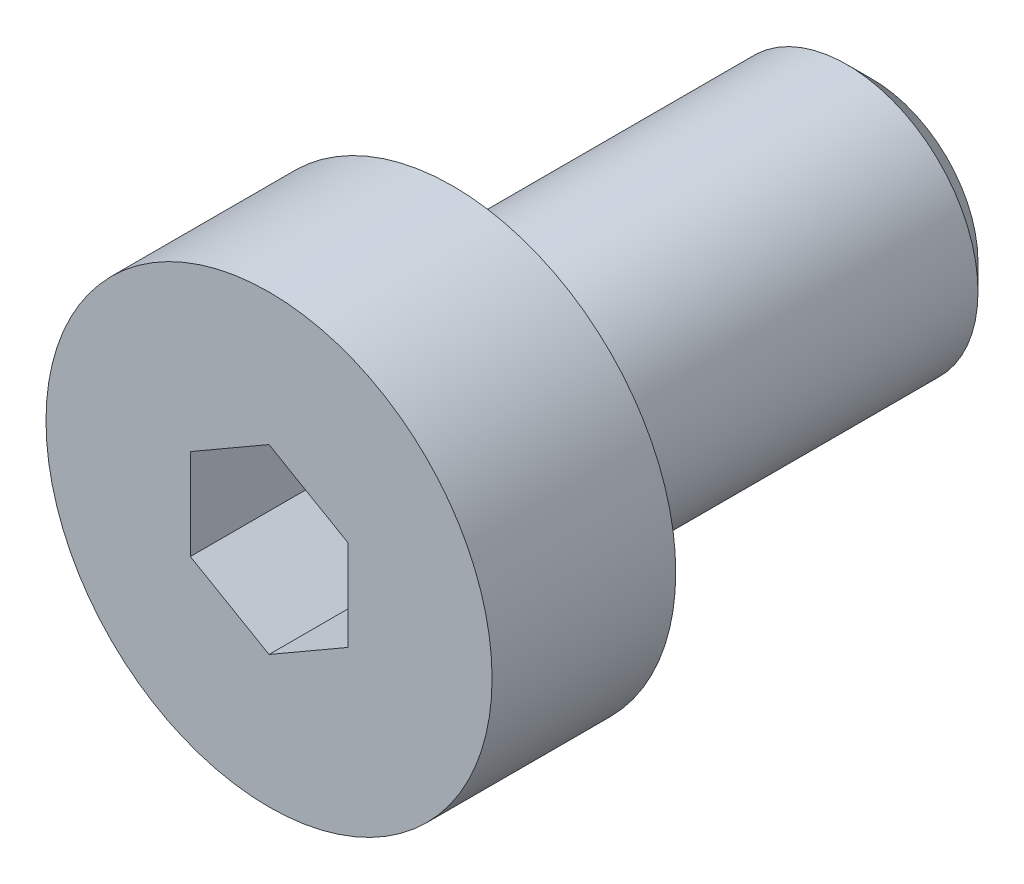
ISO-10303-21;
HEADER;
FILE_DESCRIPTION(('STEP AP214'),'2;1');
FILE_NAME('part.step','',(''),(''),'','','');
FILE_SCHEMA(('AUTOMOTIVE_DESIGN { 1 0 10303 214 1 1 1 1 }'));
ENDSEC;
DATA;
#1=APPLICATION_CONTEXT('core data for automotive mechanical design processes');
#2=APPLICATION_PROTOCOL_DEFINITION('international standard','automotive_design',2000,#1);
#3=PRODUCT_CONTEXT('',#1,'mechanical');
#4=PRODUCT('Part','Part','',(#3));
#5=PRODUCT_RELATED_PRODUCT_CATEGORY('part','',(#4));
#6=PRODUCT_DEFINITION_FORMATION('','',#4);
#7=PRODUCT_DEFINITION_CONTEXT('part definition',#1,'design');
#8=PRODUCT_DEFINITION('design','',#6,#7);
#9=PRODUCT_DEFINITION_SHAPE('','',#8);
#10=(LENGTH_UNIT() NAMED_UNIT(*) SI_UNIT(.MILLI.,.METRE.));
#11=(NAMED_UNIT(*) PLANE_ANGLE_UNIT() SI_UNIT($,.RADIAN.));
#12=(NAMED_UNIT(*) SI_UNIT($,.STERADIAN.) SOLID_ANGLE_UNIT());
#13=UNCERTAINTY_MEASURE_WITH_UNIT(LENGTH_MEASURE(1.E-05),#10,'distance_accuracy_value','');
#14=(GEOMETRIC_REPRESENTATION_CONTEXT(3) GLOBAL_UNCERTAINTY_ASSIGNED_CONTEXT((#13)) GLOBAL_UNIT_ASSIGNED_CONTEXT((#10,
#11,#12)) REPRESENTATION_CONTEXT('',''));
#15=CARTESIAN_POINT('',(0.,0.,0.));
#16=DIRECTION('',(0.,0.,1.));
#17=DIRECTION('',(1.,0.,0.));
#18=AXIS2_PLACEMENT_3D('',#15,#16,#17);
#19=CARTESIAN_POINT('',(13.,-21.5,-3.3));
#20=DIRECTION('',(0.,0.,-1.));
#21=DIRECTION('',(-1.,0.,0.));
#22=AXIS2_PLACEMENT_3D('',#19,#20,#21);
#23=PLANE('',#22);
#24=DIRECTION('',(-0.866025403784439,0.5,0.));
#25=VECTOR('',#24,1.);
#26=CARTESIAN_POINT('',(14.5,-20.6339745962156,-3.3));
#27=LINE('',#26,#25);
#28=CARTESIAN_POINT('',(13.7500000000061,-20.2009618943127,-3.29999999999145));
#29=VERTEX_POINT('',#28);
#30=CARTESIAN_POINT('',(13.,-19.7679491924311,-3.3));
#31=VERTEX_POINT('',#30);
#32=EDGE_CURVE('E179',#29,#31,#27,.T.);
#33=ORIENTED_EDGE('',*,*,#32,.T.);
#34=DIRECTION('',(-0.866025403784439,-0.5,0.));
#35=VECTOR('',#34,1.);
#36=CARTESIAN_POINT('',(13.,-19.7679491924311,-3.3));
#37=LINE('',#36,#35);
#38=CARTESIAN_POINT('',(12.2499999999939,-20.2009618943127,-3.29999999999145));
#39=VERTEX_POINT('',#38);
#40=EDGE_CURVE('E169',#31,#39,#37,.T.);
#41=ORIENTED_EDGE('',*,*,#40,.T.);
#42=CARTESIAN_POINT('',(13.,-21.5,-3.2999999999829));
#43=DIRECTION('',(0.,0.,1.));
#44=DIRECTION('',(1.,0.,0.));
#45=AXIS2_PLACEMENT_3D('',#42,#43,#44);
#46=CIRCLE('',#45,1.50000000002456);
#47=EDGE_CURVE('E130',#39,#29,#46,.F.);
#48=ORIENTED_EDGE('',*,*,#47,.T.);
#49=EDGE_LOOP('',(#33,#41,#48));
#50=FACE_BOUND('',#49,.T.);
#51=ADVANCED_FACE('F17',(#50),#23,.F.);
#52=CARTESIAN_POINT('',(13.,-21.5,-3.3));
#53=DIRECTION('',(0.,0.,-1.));
#54=DIRECTION('',(-1.,0.,0.));
#55=AXIS2_PLACEMENT_3D('',#52,#53,#54);
#56=PLANE('',#55);
#57=DIRECTION('',(0.,1.,0.));
#58=VECTOR('',#57,1.);
#59=CARTESIAN_POINT('',(14.5,-22.3660254037844,-3.3));
#60=LINE('',#59,#58);
#61=CARTESIAN_POINT('',(14.5000000000123,-21.5,-3.29999999999145));
#62=VERTEX_POINT('',#61);
#63=CARTESIAN_POINT('',(14.5,-20.6339745962156,-3.3));
#64=VERTEX_POINT('',#63);
#65=EDGE_CURVE('E147',#62,#64,#60,.T.);
#66=ORIENTED_EDGE('',*,*,#65,.T.);
#67=DIRECTION('',(-0.866025403784439,0.5,0.));
#68=VECTOR('',#67,1.);
#69=CARTESIAN_POINT('',(14.5,-20.6339745962156,-3.3));
#70=LINE('',#69,#68);
#71=EDGE_CURVE('E176',#64,#29,#70,.T.);
#72=ORIENTED_EDGE('',*,*,#71,.T.);
#73=CARTESIAN_POINT('',(13.,-21.5,-3.2999999999829));
#74=DIRECTION('',(0.,0.,1.));
#75=DIRECTION('',(1.,0.,0.));
#76=AXIS2_PLACEMENT_3D('',#73,#74,#75);
#77=CIRCLE('',#76,1.50000000002456);
#78=EDGE_CURVE('E180',#62,#29,#77,.T.);
#79=ORIENTED_EDGE('',*,*,#78,.F.);
#80=EDGE_LOOP('',(#66,#72,#79));
#81=FACE_BOUND('',#80,.T.);
#82=ADVANCED_FACE('F512',(#81),#56,.F.);
#83=CARTESIAN_POINT('',(14.5,-20.6339745962156,-0.6));
#84=DIRECTION('',(0.5,0.866025403784439,0.));
#85=DIRECTION('',(-0.866025403784439,0.5,0.));
#86=AXIS2_PLACEMENT_3D('',#83,#84,#85);
#87=PLANE('',#86);
#88=DIRECTION('',(0.,0.,1.));
#89=VECTOR('',#88,1.);
#90=CARTESIAN_POINT('',(13.,-19.7679491924311,-0.6));
#91=LINE('',#90,#89);
#92=CARTESIAN_POINT('',(13.,-19.7679491924311,-0.6));
#93=VERTEX_POINT('',#92);
#94=EDGE_CURVE('E188',#93,#31,#91,.F.);
#95=ORIENTED_EDGE('',*,*,#94,.T.);
#96=ORIENTED_EDGE('',*,*,#32,.F.);
#97=ORIENTED_EDGE('',*,*,#71,.F.);
#98=DIRECTION('',(0.,0.,-1.));
#99=VECTOR('',#98,1.);
#100=CARTESIAN_POINT('',(14.5,-20.6339745962156,-0.6));
#101=LINE('',#100,#99);
#102=CARTESIAN_POINT('',(14.5,-20.6339745962156,-0.6));
#103=VERTEX_POINT('',#102);
#104=EDGE_CURVE('E173',#64,#103,#101,.F.);
#105=ORIENTED_EDGE('',*,*,#104,.T.);
#106=DIRECTION('',(-0.866025403784439,0.5,0.));
#107=VECTOR('',#106,1.);
#108=CARTESIAN_POINT('',(14.5,-20.6339745962156,-0.6));
#109=LINE('',#108,#107);
#110=EDGE_CURVE('E193',#93,#103,#109,.F.);
#111=ORIENTED_EDGE('',*,*,#110,.F.);
#112=EDGE_LOOP('',(#95,#96,#97,#105,#111));
#113=FACE_BOUND('',#112,.T.);
#114=ADVANCED_FACE('F502',(#113),#87,.F.);
#115=CARTESIAN_POINT('',(13.,-19.7679491924311,-0.6));
#116=DIRECTION('',(-0.5,0.866025403784439,0.));
#117=DIRECTION('',(-0.866025403784439,-0.5,0.));
#118=AXIS2_PLACEMENT_3D('',#115,#116,#117);
#119=PLANE('',#118);
#120=DIRECTION('',(0.,0.,1.));
#121=VECTOR('',#120,1.);
#122=CARTESIAN_POINT('',(11.5,-20.6339745962156,-0.6));
#123=LINE('',#122,#121);
#124=CARTESIAN_POINT('',(11.5,-20.6339745962156,-0.6));
#125=VERTEX_POINT('',#124);
#126=CARTESIAN_POINT('',(11.5,-20.6339745962156,-3.3));
#127=VERTEX_POINT('',#126);
#128=EDGE_CURVE('E155',#125,#127,#123,.F.);
#129=ORIENTED_EDGE('',*,*,#128,.T.);
#130=DIRECTION('',(0.866025403784398,0.500000000000071,0.));
#131=VECTOR('',#130,1.);
#132=CARTESIAN_POINT('',(11.5,-20.6339745962156,-3.3));
#133=LINE('',#132,#131);
#134=EDGE_CURVE('E112',#127,#39,#133,.T.);
#135=ORIENTED_EDGE('',*,*,#134,.T.);
#136=ORIENTED_EDGE('',*,*,#40,.F.);
#137=ORIENTED_EDGE('',*,*,#94,.F.);
#138=DIRECTION('',(-0.866025403784439,-0.5,0.));
#139=VECTOR('',#138,1.);
#140=CARTESIAN_POINT('',(13.,-19.7679491924311,-0.6));
#141=LINE('',#140,#139);
#142=EDGE_CURVE('E164',#125,#93,#141,.F.);
#143=ORIENTED_EDGE('',*,*,#142,.F.);
#144=EDGE_LOOP('',(#129,#135,#136,#137,#143));
#145=FACE_BOUND('',#144,.T.);
#146=ADVANCED_FACE('F492',(#145),#119,.F.);
#147=CARTESIAN_POINT('',(13.,-21.5,-3.3));
#148=DIRECTION('',(0.,0.,-1.));
#149=DIRECTION('',(-1.,0.,0.));
#150=AXIS2_PLACEMENT_3D('',#147,#148,#149);
#151=PLANE('',#150);
#152=ORIENTED_EDGE('',*,*,#134,.F.);
#153=DIRECTION('',(0.,1.,0.));
#154=VECTOR('',#153,1.);
#155=CARTESIAN_POINT('',(11.5,-20.6339745962156,-3.3));
#156=LINE('',#155,#154);
#157=CARTESIAN_POINT('',(11.4999999999877,-21.5,-3.29999999999145));
#158=VERTEX_POINT('',#157);
#159=EDGE_CURVE('E152',#127,#158,#156,.F.);
#160=ORIENTED_EDGE('',*,*,#159,.T.);
#161=CARTESIAN_POINT('',(13.,-21.5,-3.2999999999829));
#162=DIRECTION('',(0.,0.,1.));
#163=DIRECTION('',(1.,0.,0.));
#164=AXIS2_PLACEMENT_3D('',#161,#162,#163);
#165=CIRCLE('',#164,1.50000000002455);
#166=EDGE_CURVE('E111',#158,#39,#165,.F.);
#167=ORIENTED_EDGE('',*,*,#166,.T.);
#168=EDGE_LOOP('',(#152,#160,#167));
#169=FACE_BOUND('',#168,.T.);
#170=ADVANCED_FACE('F483',(#169),#151,.F.);
#171=CARTESIAN_POINT('',(13.,-21.5,-3.30000000002428));
#172=DIRECTION('',(0.,0.,1.));
#173=DIRECTION('',(1.,0.,0.));
#174=AXIS2_PLACEMENT_3D('',#171,#172,#173);
#175=CONICAL_SURFACE('',#174,1.49999999991087,1.22173047637417);
#176=CARTESIAN_POINT('',(13.,-21.5,-3.2999999999829));
#177=DIRECTION('',(0.,0.,1.));
#178=DIRECTION('',(1.,0.,0.));
#179=AXIS2_PLACEMENT_3D('',#176,#177,#178);
#180=CIRCLE('',#179,1.50000000002455);
#181=CARTESIAN_POINT('',(13.7500000000061,-22.7990381056873,-3.29999999999145));
#182=VERTEX_POINT('',#181);
#183=CARTESIAN_POINT('',(12.2499999999939,-22.7990381056873,-3.29999999999145));
#184=VERTEX_POINT('',#183);
#185=EDGE_CURVE('E98',#182,#184,#180,.F.);
#186=ORIENTED_EDGE('',*,*,#185,.F.);
#187=CARTESIAN_POINT('',(13.,-21.5,-3.2999999999829));
#188=DIRECTION('',(0.,0.,1.));
#189=DIRECTION('',(1.,0.,0.));
#190=AXIS2_PLACEMENT_3D('',#187,#188,#189);
#191=CIRCLE('',#190,1.50000000002455);
#192=EDGE_CURVE('E104',#182,#62,#191,.T.);
#193=ORIENTED_EDGE('',*,*,#192,.T.);
#194=ORIENTED_EDGE('',*,*,#78,.T.);
#195=ORIENTED_EDGE('',*,*,#47,.F.);
#196=ORIENTED_EDGE('',*,*,#166,.F.);
#197=CARTESIAN_POINT('',(13.,-21.5,-3.29999999998291));
#198=DIRECTION('',(0.,0.,1.));
#199=DIRECTION('',(1.,0.,0.));
#200=AXIS2_PLACEMENT_3D('',#197,#198,#199);
#201=CIRCLE('',#200,1.50000000002455);
#202=EDGE_CURVE('E108',#158,#184,#201,.T.);
#203=ORIENTED_EDGE('',*,*,#202,.T.);
#204=EDGE_LOOP('',(#186,#193,#194,#195,#196,#203));
#205=FACE_BOUND('',#204,.T.);
#206=CARTESIAN_POINT('',(13.,-21.50000000006,-3.84595535138033));
#207=VERTEX_POINT('',#206);
#208=VERTEX_LOOP('',#207);
#209=FACE_BOUND('',#208,.T.);
#210=ADVANCED_FACE('F100',(#205,#209),#175,.F.);
#211=CARTESIAN_POINT('',(13.,-21.5,-3.3));
#212=DIRECTION('',(0.,0.,-1.));
#213=DIRECTION('',(-1.,0.,0.));
#214=AXIS2_PLACEMENT_3D('',#211,#212,#213);
#215=PLANE('',#214);
#216=DIRECTION('',(0.866025403784439,0.5,0.));
#217=VECTOR('',#216,1.);
#218=CARTESIAN_POINT('',(13.,-23.2320508075689,-3.3));
#219=LINE('',#218,#217);
#220=CARTESIAN_POINT('',(14.5,-22.3660254037844,-3.3));
#221=VERTEX_POINT('',#220);
#222=EDGE_CURVE('E123',#182,#221,#219,.T.);
#223=ORIENTED_EDGE('',*,*,#222,.T.);
#224=DIRECTION('',(0.,1.,0.));
#225=VECTOR('',#224,1.);
#226=CARTESIAN_POINT('',(14.5,-22.3660254037844,-3.3));
#227=LINE('',#226,#225);
#228=EDGE_CURVE('E128',#221,#62,#227,.T.);
#229=ORIENTED_EDGE('',*,*,#228,.T.);
#230=ORIENTED_EDGE('',*,*,#192,.F.);
#231=EDGE_LOOP('',(#223,#229,#230));
#232=FACE_BOUND('',#231,.T.);
#233=ADVANCED_FACE('F126',(#232),#215,.F.);
#234=CARTESIAN_POINT('',(14.5,-22.3660254037844,-0.6));
#235=DIRECTION('',(1.,0.,0.));
#236=DIRECTION('',(0.,0.,-1.));
#237=AXIS2_PLACEMENT_3D('',#234,#235,#236);
#238=PLANE('',#237);
#239=ORIENTED_EDGE('',*,*,#104,.F.);
#240=ORIENTED_EDGE('',*,*,#65,.F.);
#241=ORIENTED_EDGE('',*,*,#228,.F.);
#242=DIRECTION('',(0.,0.,1.));
#243=VECTOR('',#242,1.);
#244=CARTESIAN_POINT('',(14.5,-22.3660254037844,-0.6));
#245=LINE('',#244,#243);
#246=CARTESIAN_POINT('',(14.5,-22.3660254037844,-0.6));
#247=VERTEX_POINT('',#246);
#248=EDGE_CURVE('E136',#221,#247,#245,.T.);
#249=ORIENTED_EDGE('',*,*,#248,.T.);
#250=DIRECTION('',(0.,1.,0.));
#251=VECTOR('',#250,1.);
#252=CARTESIAN_POINT('',(14.5,-22.3660254037844,-0.6));
#253=LINE('',#252,#251);
#254=EDGE_CURVE('E159',#103,#247,#253,.F.);
#255=ORIENTED_EDGE('',*,*,#254,.F.);
#256=EDGE_LOOP('',(#239,#240,#241,#249,#255));
#257=FACE_BOUND('',#256,.T.);
#258=ADVANCED_FACE('F285',(#257),#238,.F.);
#259=CARTESIAN_POINT('',(11.5,-20.6339745962156,-0.6));
#260=DIRECTION('',(-1.,0.,0.));
#261=DIRECTION('',(0.,0.,1.));
#262=AXIS2_PLACEMENT_3D('',#259,#260,#261);
#263=PLANE('',#262);
#264=DIRECTION('',(0.,0.,1.));
#265=VECTOR('',#264,1.);
#266=CARTESIAN_POINT('',(11.5,-22.3660254037844,-0.6));
#267=LINE('',#266,#265);
#268=CARTESIAN_POINT('',(11.5,-22.3660254037844,-0.6));
#269=VERTEX_POINT('',#268);
#270=CARTESIAN_POINT('',(11.5,-22.3660254037844,-3.3));
#271=VERTEX_POINT('',#270);
#272=EDGE_CURVE('E238',#269,#271,#267,.F.);
#273=ORIENTED_EDGE('',*,*,#272,.T.);
#274=DIRECTION('',(0.,1.,0.));
#275=VECTOR('',#274,1.);
#276=CARTESIAN_POINT('',(11.5,-21.5,-3.3));
#277=LINE('',#276,#275);
#278=EDGE_CURVE('E216',#271,#158,#277,.T.);
#279=ORIENTED_EDGE('',*,*,#278,.T.);
#280=ORIENTED_EDGE('',*,*,#159,.F.);
#281=ORIENTED_EDGE('',*,*,#128,.F.);
#282=DIRECTION('',(0.,1.,0.));
#283=VECTOR('',#282,1.);
#284=CARTESIAN_POINT('',(11.5,-20.6339745962156,-0.6));
#285=LINE('',#284,#283);
#286=EDGE_CURVE('E154',#269,#125,#285,.T.);
#287=ORIENTED_EDGE('',*,*,#286,.F.);
#288=EDGE_LOOP('',(#273,#279,#280,#281,#287));
#289=FACE_BOUND('',#288,.T.);
#290=ADVANCED_FACE('F273',(#289),#263,.F.);
#291=CARTESIAN_POINT('',(13.,-21.5,-3.3));
#292=DIRECTION('',(0.,0.,-1.));
#293=DIRECTION('',(-1.,0.,0.));
#294=AXIS2_PLACEMENT_3D('',#291,#292,#293);
#295=PLANE('',#294);
#296=ORIENTED_EDGE('',*,*,#278,.F.);
#297=DIRECTION('',(0.866025403784439,-0.5,0.));
#298=VECTOR('',#297,1.);
#299=CARTESIAN_POINT('',(11.5,-22.3660254037844,-3.3));
#300=LINE('',#299,#298);
#301=EDGE_CURVE('E239',#271,#184,#300,.T.);
#302=ORIENTED_EDGE('',*,*,#301,.T.);
#303=ORIENTED_EDGE('',*,*,#202,.F.);
#304=EDGE_LOOP('',(#296,#302,#303));
#305=FACE_BOUND('',#304,.T.);
#306=ADVANCED_FACE('F276',(#305),#295,.F.);
#307=CARTESIAN_POINT('',(13.,-21.5,-3.3));
#308=DIRECTION('',(0.,0.,-1.));
#309=DIRECTION('',(-1.,0.,0.));
#310=AXIS2_PLACEMENT_3D('',#307,#308,#309);
#311=PLANE('',#310);
#312=DIRECTION('',(0.866025403784439,-0.5,0.));
#313=VECTOR('',#312,1.);
#314=CARTESIAN_POINT('',(11.5,-22.3660254037844,-3.3));
#315=LINE('',#314,#313);
#316=CARTESIAN_POINT('',(13.,-23.2320508075689,-3.3));
#317=VERTEX_POINT('',#316);
#318=EDGE_CURVE('E118',#184,#317,#315,.T.);
#319=ORIENTED_EDGE('',*,*,#318,.T.);
#320=DIRECTION('',(0.866025403784439,0.5,0.));
#321=VECTOR('',#320,1.);
#322=CARTESIAN_POINT('',(13.,-23.2320508075689,-3.3));
#323=LINE('',#322,#321);
#324=EDGE_CURVE('E115',#317,#182,#323,.T.);
#325=ORIENTED_EDGE('',*,*,#324,.T.);
#326=ORIENTED_EDGE('',*,*,#185,.T.);
#327=EDGE_LOOP('',(#319,#325,#326));
#328=FACE_BOUND('',#327,.T.);
#329=ADVANCED_FACE('F116',(#328),#311,.F.);
#330=CARTESIAN_POINT('',(13.,-23.2320508075689,-0.6));
#331=DIRECTION('',(0.5,-0.866025403784439,0.));
#332=DIRECTION('',(0.866025403784439,0.5,0.));
#333=AXIS2_PLACEMENT_3D('',#330,#331,#332);
#334=PLANE('',#333);
#335=ORIENTED_EDGE('',*,*,#248,.F.);
#336=ORIENTED_EDGE('',*,*,#222,.F.);
#337=ORIENTED_EDGE('',*,*,#324,.F.);
#338=DIRECTION('',(0.,0.,1.));
#339=VECTOR('',#338,1.);
#340=CARTESIAN_POINT('',(13.,-23.2320508075689,-0.6));
#341=LINE('',#340,#339);
#342=CARTESIAN_POINT('',(13.,-23.2320508075689,-0.6));
#343=VERTEX_POINT('',#342);
#344=EDGE_CURVE('E244',#317,#343,#341,.T.);
#345=ORIENTED_EDGE('',*,*,#344,.T.);
#346=DIRECTION('',(0.866025403784439,0.5,0.));
#347=VECTOR('',#346,1.);
#348=CARTESIAN_POINT('',(13.,-23.2320508075689,-0.6));
#349=LINE('',#348,#347);
#350=EDGE_CURVE('E138',#247,#343,#349,.F.);
#351=ORIENTED_EDGE('',*,*,#350,.F.);
#352=EDGE_LOOP('',(#335,#336,#337,#345,#351));
#353=FACE_BOUND('',#352,.T.);
#354=ADVANCED_FACE('F133',(#353),#334,.F.);
#355=CARTESIAN_POINT('',(11.5,-22.3660254037844,-0.6));
#356=DIRECTION('',(-0.5,-0.866025403784439,0.));
#357=DIRECTION('',(0.866025403784439,-0.5,0.));
#358=AXIS2_PLACEMENT_3D('',#355,#356,#357);
#359=PLANE('',#358);
#360=ORIENTED_EDGE('',*,*,#344,.F.);
#361=ORIENTED_EDGE('',*,*,#318,.F.);
#362=ORIENTED_EDGE('',*,*,#301,.F.);
#363=ORIENTED_EDGE('',*,*,#272,.F.);
#364=DIRECTION('',(-0.866025403784423,0.500000000000027,0.));
#365=VECTOR('',#364,1.);
#366=CARTESIAN_POINT('',(13.,-23.2320508075689,-0.6));
#367=LINE('',#366,#365);
#368=EDGE_CURVE('E215',#343,#269,#367,.T.);
#369=ORIENTED_EDGE('',*,*,#368,.F.);
#370=EDGE_LOOP('',(#360,#361,#362,#363,#369));
#371=FACE_BOUND('',#370,.T.);
#372=ADVANCED_FACE('F269',(#371),#359,.F.);
#373=CARTESIAN_POINT('',(13.,-23.625,-0.6));
#374=DIRECTION('',(0.,0.,1.));
#375=DIRECTION('',(1.,0.,0.));
#376=AXIS2_PLACEMENT_3D('',#373,#374,#375);
#377=PLANE('',#376);
#378=CARTESIAN_POINT('',(13.,-21.5,-0.6));
#379=DIRECTION('',(0.,0.,-1.));
#380=DIRECTION('',(-1.,0.,0.));
#381=AXIS2_PLACEMENT_3D('',#378,#379,#380);
#382=CIRCLE('',#381,4.25);
#383=CARTESIAN_POINT('',(8.75,-21.5,-0.6));
#384=VERTEX_POINT('',#383);
#385=EDGE_CURVE('E212',#384,#384,#382,.T.);
#386=ORIENTED_EDGE('',*,*,#385,.F.);
#387=EDGE_LOOP('',(#386));
#388=FACE_BOUND('',#387,.T.);
#389=ORIENTED_EDGE('',*,*,#350,.T.);
#390=ORIENTED_EDGE('',*,*,#368,.T.);
#391=ORIENTED_EDGE('',*,*,#286,.T.);
#392=ORIENTED_EDGE('',*,*,#142,.T.);
#393=ORIENTED_EDGE('',*,*,#110,.T.);
#394=ORIENTED_EDGE('',*,*,#254,.T.);
#395=EDGE_LOOP('',(#389,#390,#391,#392,#393,#394));
#396=FACE_BOUND('',#395,.T.);
#397=ADVANCED_FACE('F265',(#388,#396),#377,.T.);
#398=CARTESIAN_POINT('',(13.,-21.5,-2.35));
#399=DIRECTION('',(0.,0.,-1.));
#400=DIRECTION('',(-1.,0.,0.));
#401=AXIS2_PLACEMENT_3D('',#398,#399,#400);
#402=CYLINDRICAL_SURFACE('',#401,4.25);
#403=ORIENTED_EDGE('',*,*,#385,.T.);
#404=EDGE_LOOP('',(#403));
#405=FACE_BOUND('',#404,.T.);
#406=CARTESIAN_POINT('',(13.,-21.5,-4.1));
#407=DIRECTION('',(0.,0.,-1.));
#408=DIRECTION('',(-1.,0.,0.));
#409=AXIS2_PLACEMENT_3D('',#406,#407,#408);
#410=CIRCLE('',#409,4.25);
#411=CARTESIAN_POINT('',(8.75,-21.5,-4.1));
#412=VERTEX_POINT('',#411);
#413=EDGE_CURVE('E209',#412,#412,#410,.T.);
#414=ORIENTED_EDGE('',*,*,#413,.F.);
#415=EDGE_LOOP('',(#414));
#416=FACE_BOUND('',#415,.T.);
#417=ADVANCED_FACE('F350',(#405,#416),#402,.T.);
#418=CARTESIAN_POINT('',(13.,-22.50475,-12.1));
#419=DIRECTION('',(0.,0.,-1.));
#420=DIRECTION('',(-1.,0.,0.));
#421=AXIS2_PLACEMENT_3D('',#418,#419,#420);
#422=PLANE('',#421);
#423=CARTESIAN_POINT('',(13.,-21.5,-12.0999999999754));
#424=DIRECTION('',(0.,0.,1.));
#425=DIRECTION('',(1.,0.,0.));
#426=AXIS2_PLACEMENT_3D('',#423,#424,#425);
#427=CIRCLE('',#426,2.00950000004559);
#428=CARTESIAN_POINT('',(15.0095000000456,-21.5,-12.0999999999754));
#429=VERTEX_POINT('',#428);
#430=EDGE_CURVE('E205',#429,#429,#427,.T.);
#431=ORIENTED_EDGE('',*,*,#430,.F.);
#432=EDGE_LOOP('',(#431));
#433=FACE_BOUND('',#432,.T.);
#434=ADVANCED_FACE('F316',(#433),#422,.T.);
#435=CARTESIAN_POINT('',(13.,-24.975,-4.1));
#436=DIRECTION('',(0.,0.,-1.));
#437=DIRECTION('',(-1.,0.,0.));
#438=AXIS2_PLACEMENT_3D('',#435,#436,#437);
#439=PLANE('',#438);
#440=CARTESIAN_POINT('',(13.,-21.5,-4.1));
#441=DIRECTION('',(0.,0.,-1.));
#442=DIRECTION('',(-1.,0.,0.));
#443=AXIS2_PLACEMENT_3D('',#440,#441,#442);
#444=CIRCLE('',#443,2.7);
#445=CARTESIAN_POINT('',(15.7,-21.5,-4.1));
#446=VERTEX_POINT('',#445);
#447=CARTESIAN_POINT('',(10.3,-21.5,-4.1));
#448=VERTEX_POINT('',#447);
#449=EDGE_CURVE('E208',#446,#448,#444,.F.);
#450=ORIENTED_EDGE('',*,*,#449,.T.);
#451=CARTESIAN_POINT('',(13.,-21.5,-4.1));
#452=DIRECTION('',(0.,0.,-1.));
#453=DIRECTION('',(0.,-1.,0.));
#454=AXIS2_PLACEMENT_3D('',#451,#452,#453);
#455=CIRCLE('',#454,2.7);
#456=CARTESIAN_POINT('',(13.,-24.2,-4.1));
#457=VERTEX_POINT('',#456);
#458=EDGE_CURVE('E227',#448,#457,#455,.F.);
#459=ORIENTED_EDGE('',*,*,#458,.T.);
#460=CARTESIAN_POINT('',(13.,-21.5,-4.1));
#461=DIRECTION('',(0.,0.,-1.));
#462=DIRECTION('',(1.,0.,0.));
#463=AXIS2_PLACEMENT_3D('',#460,#461,#462);
#464=CIRCLE('',#463,2.7);
#465=EDGE_CURVE('E37',#457,#446,#464,.F.);
#466=ORIENTED_EDGE('',*,*,#465,.T.);
#467=EDGE_LOOP('',(#450,#459,#466));
#468=FACE_BOUND('',#467,.T.);
#469=ORIENTED_EDGE('',*,*,#413,.T.);
#470=EDGE_LOOP('',(#469));
#471=FACE_BOUND('',#470,.T.);
#472=ADVANCED_FACE('F307',(#468,#471),#439,.T.);
#473=CARTESIAN_POINT('',(13.,-21.5,-11.60950000002));
#474=DIRECTION('',(0.,0.,1.));
#475=DIRECTION('',(1.,0.,0.));
#476=AXIS2_PLACEMENT_3D('',#473,#474,#475);
#477=CONICAL_SURFACE('',#476,2.50000000000091,0.785398163397448);
#478=ORIENTED_EDGE('',*,*,#430,.T.);
#479=EDGE_LOOP('',(#478));
#480=FACE_BOUND('',#479,.T.);
#481=CARTESIAN_POINT('',(13.,-21.5,-11.6095));
#482=DIRECTION('',(0.,0.,-1.));
#483=DIRECTION('',(-1.,0.,0.));
#484=AXIS2_PLACEMENT_3D('',#481,#482,#483);
#485=CIRCLE('',#484,2.5);
#486=CARTESIAN_POINT('',(10.5,-21.5,-11.6095));
#487=VERTEX_POINT('',#486);
#488=EDGE_CURVE('E28',#487,#487,#485,.F.);
#489=ORIENTED_EDGE('',*,*,#488,.F.);
#490=EDGE_LOOP('',(#489));
#491=FACE_BOUND('',#490,.T.);
#492=ADVANCED_FACE('F293',(#480,#491),#477,.T.);
#493=CARTESIAN_POINT('',(13.,-21.5,-4.3));
#494=DIRECTION('',(0.,0.,1.));
#495=DIRECTION('',(-1.,0.,0.));
#496=AXIS2_PLACEMENT_3D('',#493,#494,#495);
#497=TOROIDAL_SURFACE('',#496,2.7,0.2);
#498=ORIENTED_EDGE('',*,*,#458,.F.);
#499=ORIENTED_EDGE('',*,*,#449,.F.);
#500=ORIENTED_EDGE('',*,*,#465,.F.);
#501=EDGE_LOOP('',(#498,#499,#500));
#502=FACE_BOUND('',#501,.T.);
#503=CARTESIAN_POINT('',(13.,-21.5,-4.3));
#504=DIRECTION('',(0.,0.,-1.));
#505=DIRECTION('',(-1.,0.,0.));
#506=AXIS2_PLACEMENT_3D('',#503,#504,#505);
#507=CIRCLE('',#506,2.5);
#508=CARTESIAN_POINT('',(10.5,-21.5,-4.3));
#509=VERTEX_POINT('',#508);
#510=EDGE_CURVE('E11',#509,#509,#507,.T.);
#511=ORIENTED_EDGE('',*,*,#510,.F.);
#512=EDGE_LOOP('',(#511));
#513=FACE_BOUND('',#512,.T.);
#514=ADVANCED_FACE('F224',(#502,#513),#497,.F.);
#515=CARTESIAN_POINT('',(13.,-21.5,-7.95475));
#516=DIRECTION('',(0.,0.,-1.));
#517=DIRECTION('',(-1.,0.,0.));
#518=AXIS2_PLACEMENT_3D('',#515,#516,#517);
#519=CYLINDRICAL_SURFACE('',#518,2.5);
#520=ORIENTED_EDGE('',*,*,#488,.T.);
#521=EDGE_LOOP('',(#520));
#522=FACE_BOUND('',#521,.T.);
#523=ORIENTED_EDGE('',*,*,#510,.T.);
#524=EDGE_LOOP('',(#523));
#525=FACE_BOUND('',#524,.T.);
#526=ADVANCED_FACE('F287',(#522,#525),#519,.T.);
#527=CLOSED_SHELL('',(#51,#82,#114,#146,#170,#210,#233,#258,#290,#306,#329,#354,#372,#397,#417,
#434,#472,#492,#514,#526));
#528=MANIFOLD_SOLID_BREP('B1',#527);
#529=ADVANCED_BREP_SHAPE_REPRESENTATION('',(#18,#528),#14);
#530=SHAPE_DEFINITION_REPRESENTATION(#9,#529);
ENDSEC;
END-ISO-10303-21;
